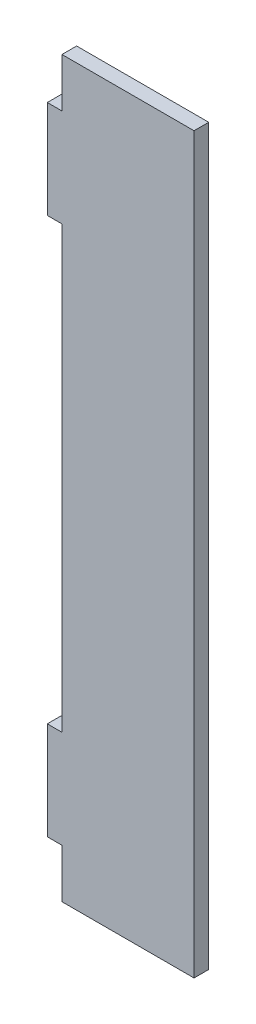
ISO-10303-21;
HEADER;
FILE_DESCRIPTION(('STEP AP214'),'2;1');
FILE_NAME('part.step','',(''),(''),'','','');
FILE_SCHEMA(('AUTOMOTIVE_DESIGN { 1 0 10303 214 1 1 1 1 }'));
ENDSEC;
DATA;
#1=APPLICATION_CONTEXT('core data for automotive mechanical design processes');
#2=APPLICATION_PROTOCOL_DEFINITION('international standard','automotive_design',2000,#1);
#3=PRODUCT_CONTEXT('',#1,'mechanical');
#4=PRODUCT('Part','Part','',(#3));
#5=PRODUCT_RELATED_PRODUCT_CATEGORY('part','',(#4));
#6=PRODUCT_DEFINITION_FORMATION('','',#4);
#7=PRODUCT_DEFINITION_CONTEXT('part definition',#1,'design');
#8=PRODUCT_DEFINITION('design','',#6,#7);
#9=PRODUCT_DEFINITION_SHAPE('','',#8);
#10=(LENGTH_UNIT() NAMED_UNIT(*) SI_UNIT(.MILLI.,.METRE.));
#11=(NAMED_UNIT(*) PLANE_ANGLE_UNIT() SI_UNIT($,.RADIAN.));
#12=(NAMED_UNIT(*) SI_UNIT($,.STERADIAN.) SOLID_ANGLE_UNIT());
#13=UNCERTAINTY_MEASURE_WITH_UNIT(LENGTH_MEASURE(1.E-05),#10,'distance_accuracy_value','');
#14=(GEOMETRIC_REPRESENTATION_CONTEXT(3) GLOBAL_UNCERTAINTY_ASSIGNED_CONTEXT((#13)) GLOBAL_UNIT_ASSIGNED_CONTEXT((#10,
#11,#12)) REPRESENTATION_CONTEXT('',''));
#15=CARTESIAN_POINT('',(0.,0.,0.));
#16=DIRECTION('',(0.,0.,1.));
#17=DIRECTION('',(1.,0.,0.));
#18=AXIS2_PLACEMENT_3D('',#15,#16,#17);
#19=CARTESIAN_POINT('',(-15.,-75.,3.));
#20=DIRECTION('',(1.,0.,0.));
#21=DIRECTION('',(0.,1.,0.));
#22=AXIS2_PLACEMENT_3D('',#19,#20,#21);
#23=PLANE('',#22);
#24=DIRECTION('',(0.,-1.,0.));
#25=VECTOR('',#24,1.);
#26=CARTESIAN_POINT('',(-15.,-75.,3.));
#27=LINE('',#26,#25);
#28=CARTESIAN_POINT('',(-15.,65.,3.));
#29=VERTEX_POINT('',#28);
#30=CARTESIAN_POINT('',(-15.,45.,3.));
#31=VERTEX_POINT('',#30);
#32=EDGE_CURVE('E142',#29,#31,#27,.T.);
#33=ORIENTED_EDGE('',*,*,#32,.F.);
#34=DIRECTION('',(0.,0.,1.));
#35=VECTOR('',#34,1.);
#36=CARTESIAN_POINT('',(-15.,65.,0.));
#37=LINE('',#36,#35);
#38=CARTESIAN_POINT('',(-15.,65.,0.));
#39=VERTEX_POINT('',#38);
#40=EDGE_CURVE('E129',#39,#29,#37,.T.);
#41=ORIENTED_EDGE('',*,*,#40,.F.);
#42=DIRECTION('',(0.,-1.,0.));
#43=VECTOR('',#42,1.);
#44=CARTESIAN_POINT('',(-15.,-75.,0.));
#45=LINE('',#44,#43);
#46=CARTESIAN_POINT('',(-15.,45.,0.));
#47=VERTEX_POINT('',#46);
#48=EDGE_CURVE('E140',#39,#47,#45,.T.);
#49=ORIENTED_EDGE('',*,*,#48,.T.);
#50=DIRECTION('',(0.,0.,1.));
#51=VECTOR('',#50,1.);
#52=CARTESIAN_POINT('',(-15.,45.,0.));
#53=LINE('',#52,#51);
#54=EDGE_CURVE('E209',#47,#31,#53,.T.);
#55=ORIENTED_EDGE('',*,*,#54,.T.);
#56=EDGE_LOOP('',(#33,#41,#49,#55));
#57=FACE_BOUND('',#56,.T.);
#58=ADVANCED_FACE('F37',(#57),#23,.F.);
#59=CARTESIAN_POINT('',(15.,-75.,3.));
#60=DIRECTION('',(-1.,0.,0.));
#61=DIRECTION('',(0.,-1.,0.));
#62=AXIS2_PLACEMENT_3D('',#59,#60,#61);
#63=PLANE('',#62);
#64=DIRECTION('',(0.,1.,0.));
#65=VECTOR('',#64,1.);
#66=CARTESIAN_POINT('',(15.,-75.,0.));
#67=LINE('',#66,#65);
#68=CARTESIAN_POINT('',(15.,-75.,0.));
#69=VERTEX_POINT('',#68);
#70=CARTESIAN_POINT('',(15.,75.,0.));
#71=VERTEX_POINT('',#70);
#72=EDGE_CURVE('E173',#69,#71,#67,.T.);
#73=ORIENTED_EDGE('',*,*,#72,.T.);
#74=DIRECTION('',(0.,0.,-1.));
#75=VECTOR('',#74,1.);
#76=CARTESIAN_POINT('',(15.,75.,3.));
#77=LINE('',#76,#75);
#78=CARTESIAN_POINT('',(15.,75.,3.));
#79=VERTEX_POINT('',#78);
#80=EDGE_CURVE('E11',#79,#71,#77,.T.);
#81=ORIENTED_EDGE('',*,*,#80,.F.);
#82=DIRECTION('',(0.,1.,0.));
#83=VECTOR('',#82,1.);
#84=CARTESIAN_POINT('',(15.,-75.,3.));
#85=LINE('',#84,#83);
#86=CARTESIAN_POINT('',(15.,-75.,3.));
#87=VERTEX_POINT('',#86);
#88=EDGE_CURVE('E152',#87,#79,#85,.T.);
#89=ORIENTED_EDGE('',*,*,#88,.F.);
#90=DIRECTION('',(0.,0.,-1.));
#91=VECTOR('',#90,1.);
#92=CARTESIAN_POINT('',(15.,-75.,3.));
#93=LINE('',#92,#91);
#94=EDGE_CURVE('E45',#87,#69,#93,.T.);
#95=ORIENTED_EDGE('',*,*,#94,.T.);
#96=EDGE_LOOP('',(#73,#81,#89,#95));
#97=FACE_BOUND('',#96,.T.);
#98=ADVANCED_FACE('F39',(#97),#63,.F.);
#99=CARTESIAN_POINT('',(-15.,75.,3.));
#100=DIRECTION('',(0.,-1.,0.));
#101=DIRECTION('',(0.,0.,-1.));
#102=AXIS2_PLACEMENT_3D('',#99,#100,#101);
#103=PLANE('',#102);
#104=DIRECTION('',(-1.,0.,0.));
#105=VECTOR('',#104,1.);
#106=CARTESIAN_POINT('',(-15.,75.,0.));
#107=LINE('',#106,#105);
#108=CARTESIAN_POINT('',(-12.,75.,0.));
#109=VERTEX_POINT('',#108);
#110=EDGE_CURVE('E155',#71,#109,#107,.T.);
#111=ORIENTED_EDGE('',*,*,#110,.T.);
#112=DIRECTION('',(0.,0.,1.));
#113=VECTOR('',#112,1.);
#114=CARTESIAN_POINT('',(-12.,75.,0.));
#115=LINE('',#114,#113);
#116=CARTESIAN_POINT('',(-12.,75.,3.));
#117=VERTEX_POINT('',#116);
#118=EDGE_CURVE('E174',#109,#117,#115,.T.);
#119=ORIENTED_EDGE('',*,*,#118,.T.);
#120=DIRECTION('',(-1.,0.,0.));
#121=VECTOR('',#120,1.);
#122=CARTESIAN_POINT('',(-15.,75.,3.));
#123=LINE('',#122,#121);
#124=EDGE_CURVE('E224',#79,#117,#123,.T.);
#125=ORIENTED_EDGE('',*,*,#124,.F.);
#126=ORIENTED_EDGE('',*,*,#80,.T.);
#127=EDGE_LOOP('',(#111,#119,#125,#126));
#128=FACE_BOUND('',#127,.T.);
#129=ADVANCED_FACE('F243',(#128),#103,.F.);
#130=CARTESIAN_POINT('',(-15.,-45.,0.));
#131=VERTEX_POINT('',#130);
#132=CARTESIAN_POINT('',(-15.,-65.,0.));
#133=VERTEX_POINT('',#132);
#134=EDGE_CURVE('E150',#131,#133,#45,.T.);
#135=ORIENTED_EDGE('',*,*,#134,.T.);
#136=DIRECTION('',(0.,0.,1.));
#137=VECTOR('',#136,1.);
#138=CARTESIAN_POINT('',(-15.,-65.,0.));
#139=LINE('',#138,#137);
#140=CARTESIAN_POINT('',(-15.,-65.,3.));
#141=VERTEX_POINT('',#140);
#142=EDGE_CURVE('E189',#133,#141,#139,.T.);
#143=ORIENTED_EDGE('',*,*,#142,.T.);
#144=CARTESIAN_POINT('',(-15.,-45.,3.));
#145=VERTEX_POINT('',#144);
#146=EDGE_CURVE('E170',#145,#141,#27,.T.);
#147=ORIENTED_EDGE('',*,*,#146,.F.);
#148=DIRECTION('',(0.,0.,1.));
#149=VECTOR('',#148,1.);
#150=CARTESIAN_POINT('',(-15.,-45.,0.));
#151=LINE('',#150,#149);
#152=EDGE_CURVE('E203',#131,#145,#151,.T.);
#153=ORIENTED_EDGE('',*,*,#152,.F.);
#154=EDGE_LOOP('',(#135,#143,#147,#153));
#155=FACE_BOUND('',#154,.T.);
#156=ADVANCED_FACE('F234',(#155),#23,.F.);
#157=CARTESIAN_POINT('',(-15.,-75.,3.));
#158=DIRECTION('',(0.,1.,0.));
#159=DIRECTION('',(0.,0.,1.));
#160=AXIS2_PLACEMENT_3D('',#157,#158,#159);
#161=PLANE('',#160);
#162=DIRECTION('',(1.,0.,0.));
#163=VECTOR('',#162,1.);
#164=CARTESIAN_POINT('',(-15.,-75.,3.));
#165=LINE('',#164,#163);
#166=CARTESIAN_POINT('',(-12.,-75.,3.));
#167=VERTEX_POINT('',#166);
#168=EDGE_CURVE('E159',#167,#87,#165,.T.);
#169=ORIENTED_EDGE('',*,*,#168,.F.);
#170=DIRECTION('',(0.,0.,1.));
#171=VECTOR('',#170,1.);
#172=CARTESIAN_POINT('',(-12.,-75.,0.));
#173=LINE('',#172,#171);
#174=CARTESIAN_POINT('',(-12.,-75.,0.));
#175=VERTEX_POINT('',#174);
#176=EDGE_CURVE('E185',#175,#167,#173,.T.);
#177=ORIENTED_EDGE('',*,*,#176,.F.);
#178=DIRECTION('',(1.,0.,0.));
#179=VECTOR('',#178,1.);
#180=CARTESIAN_POINT('',(-15.,-75.,0.));
#181=LINE('',#180,#179);
#182=EDGE_CURVE('E149',#175,#69,#181,.T.);
#183=ORIENTED_EDGE('',*,*,#182,.T.);
#184=ORIENTED_EDGE('',*,*,#94,.F.);
#185=EDGE_LOOP('',(#169,#177,#183,#184));
#186=FACE_BOUND('',#185,.T.);
#187=ADVANCED_FACE('F242',(#186),#161,.F.);
#188=CARTESIAN_POINT('',(0.,0.,3.));
#189=DIRECTION('',(0.,0.,-1.));
#190=DIRECTION('',(-1.,0.,0.));
#191=AXIS2_PLACEMENT_3D('',#188,#189,#190);
#192=PLANE('',#191);
#193=ORIENTED_EDGE('',*,*,#124,.T.);
#194=DIRECTION('',(0.,1.,0.));
#195=VECTOR('',#194,1.);
#196=CARTESIAN_POINT('',(-12.,75.,3.));
#197=LINE('',#196,#195);
#198=CARTESIAN_POINT('',(-12.,65.,3.));
#199=VERTEX_POINT('',#198);
#200=EDGE_CURVE('E134',#199,#117,#197,.T.);
#201=ORIENTED_EDGE('',*,*,#200,.F.);
#202=DIRECTION('',(1.,0.,0.));
#203=VECTOR('',#202,1.);
#204=CARTESIAN_POINT('',(-15.,65.,3.));
#205=LINE('',#204,#203);
#206=EDGE_CURVE('E199',#29,#199,#205,.T.);
#207=ORIENTED_EDGE('',*,*,#206,.F.);
#208=ORIENTED_EDGE('',*,*,#32,.T.);
#209=DIRECTION('',(-1.,0.,0.));
#210=VECTOR('',#209,1.);
#211=CARTESIAN_POINT('',(-15.,45.,3.));
#212=LINE('',#211,#210);
#213=CARTESIAN_POINT('',(-12.,45.,3.));
#214=VERTEX_POINT('',#213);
#215=EDGE_CURVE('E211',#214,#31,#212,.T.);
#216=ORIENTED_EDGE('',*,*,#215,.F.);
#217=DIRECTION('',(0.,1.,0.));
#218=VECTOR('',#217,1.);
#219=CARTESIAN_POINT('',(-12.,45.,3.));
#220=LINE('',#219,#218);
#221=CARTESIAN_POINT('',(-12.,-45.,3.));
#222=VERTEX_POINT('',#221);
#223=EDGE_CURVE('E213',#222,#214,#220,.T.);
#224=ORIENTED_EDGE('',*,*,#223,.F.);
#225=DIRECTION('',(1.,0.,0.));
#226=VECTOR('',#225,1.);
#227=CARTESIAN_POINT('',(-15.,-45.,3.));
#228=LINE('',#227,#226);
#229=EDGE_CURVE('E192',#145,#222,#228,.T.);
#230=ORIENTED_EDGE('',*,*,#229,.F.);
#231=ORIENTED_EDGE('',*,*,#146,.T.);
#232=DIRECTION('',(-1.,0.,0.));
#233=VECTOR('',#232,1.);
#234=CARTESIAN_POINT('',(-15.,-65.,3.));
#235=LINE('',#234,#233);
#236=CARTESIAN_POINT('',(-12.,-65.,3.));
#237=VERTEX_POINT('',#236);
#238=EDGE_CURVE('E193',#237,#141,#235,.T.);
#239=ORIENTED_EDGE('',*,*,#238,.F.);
#240=DIRECTION('',(0.,1.,0.));
#241=VECTOR('',#240,1.);
#242=CARTESIAN_POINT('',(-12.,-75.,3.));
#243=LINE('',#242,#241);
#244=EDGE_CURVE('E195',#167,#237,#243,.T.);
#245=ORIENTED_EDGE('',*,*,#244,.F.);
#246=ORIENTED_EDGE('',*,*,#168,.T.);
#247=ORIENTED_EDGE('',*,*,#88,.T.);
#248=EDGE_LOOP('',(#193,#201,#207,#208,#216,#224,#230,#231,#239,#245,#246,#247));
#249=FACE_BOUND('',#248,.T.);
#250=ADVANCED_FACE('F230',(#249),#192,.F.);
#251=CARTESIAN_POINT('',(0.,0.,0.));
#252=DIRECTION('',(0.,0.,-1.));
#253=DIRECTION('',(-1.,0.,0.));
#254=AXIS2_PLACEMENT_3D('',#251,#252,#253);
#255=PLANE('',#254);
#256=DIRECTION('',(0.,1.,0.));
#257=VECTOR('',#256,1.);
#258=CARTESIAN_POINT('',(-12.,75.,0.));
#259=LINE('',#258,#257);
#260=CARTESIAN_POINT('',(-12.,65.,0.));
#261=VERTEX_POINT('',#260);
#262=EDGE_CURVE('E52',#261,#109,#259,.T.);
#263=ORIENTED_EDGE('',*,*,#262,.T.);
#264=ORIENTED_EDGE('',*,*,#110,.F.);
#265=ORIENTED_EDGE('',*,*,#72,.F.);
#266=ORIENTED_EDGE('',*,*,#182,.F.);
#267=DIRECTION('',(0.,1.,0.));
#268=VECTOR('',#267,1.);
#269=CARTESIAN_POINT('',(-12.,-75.,0.));
#270=LINE('',#269,#268);
#271=CARTESIAN_POINT('',(-12.,-65.,0.));
#272=VERTEX_POINT('',#271);
#273=EDGE_CURVE('E196',#175,#272,#270,.T.);
#274=ORIENTED_EDGE('',*,*,#273,.T.);
#275=DIRECTION('',(-1.,0.,0.));
#276=VECTOR('',#275,1.);
#277=CARTESIAN_POINT('',(-15.,-65.,0.));
#278=LINE('',#277,#276);
#279=EDGE_CURVE('E60',#272,#133,#278,.T.);
#280=ORIENTED_EDGE('',*,*,#279,.T.);
#281=ORIENTED_EDGE('',*,*,#134,.F.);
#282=DIRECTION('',(1.,0.,0.));
#283=VECTOR('',#282,1.);
#284=CARTESIAN_POINT('',(-15.,-45.,0.));
#285=LINE('',#284,#283);
#286=CARTESIAN_POINT('',(-12.,-45.,0.));
#287=VERTEX_POINT('',#286);
#288=EDGE_CURVE('E214',#131,#287,#285,.T.);
#289=ORIENTED_EDGE('',*,*,#288,.T.);
#290=DIRECTION('',(0.,1.,0.));
#291=VECTOR('',#290,1.);
#292=CARTESIAN_POINT('',(-12.,45.,0.));
#293=LINE('',#292,#291);
#294=CARTESIAN_POINT('',(-12.,45.,0.));
#295=VERTEX_POINT('',#294);
#296=EDGE_CURVE('E220',#287,#295,#293,.T.);
#297=ORIENTED_EDGE('',*,*,#296,.T.);
#298=DIRECTION('',(-1.,0.,0.));
#299=VECTOR('',#298,1.);
#300=CARTESIAN_POINT('',(-15.,45.,0.));
#301=LINE('',#300,#299);
#302=EDGE_CURVE('E148',#295,#47,#301,.T.);
#303=ORIENTED_EDGE('',*,*,#302,.T.);
#304=ORIENTED_EDGE('',*,*,#48,.F.);
#305=DIRECTION('',(1.,0.,0.));
#306=VECTOR('',#305,1.);
#307=CARTESIAN_POINT('',(-15.,65.,0.));
#308=LINE('',#307,#306);
#309=EDGE_CURVE('E125',#39,#261,#308,.T.);
#310=ORIENTED_EDGE('',*,*,#309,.T.);
#311=EDGE_LOOP('',(#263,#264,#265,#266,#274,#280,#281,#289,#297,#303,#304,#310));
#312=FACE_BOUND('',#311,.T.);
#313=ADVANCED_FACE('F145',(#312),#255,.T.);
#314=CARTESIAN_POINT('',(-15.,45.,0.));
#315=DIRECTION('',(0.,1.,0.));
#316=DIRECTION('',(0.,0.,1.));
#317=AXIS2_PLACEMENT_3D('',#314,#315,#316);
#318=PLANE('',#317);
#319=ORIENTED_EDGE('',*,*,#215,.T.);
#320=ORIENTED_EDGE('',*,*,#54,.F.);
#321=ORIENTED_EDGE('',*,*,#302,.F.);
#322=DIRECTION('',(0.,0.,1.));
#323=VECTOR('',#322,1.);
#324=CARTESIAN_POINT('',(-12.,45.,0.));
#325=LINE('',#324,#323);
#326=EDGE_CURVE('E207',#295,#214,#325,.T.);
#327=ORIENTED_EDGE('',*,*,#326,.T.);
#328=EDGE_LOOP('',(#319,#320,#321,#327));
#329=FACE_BOUND('',#328,.T.);
#330=ADVANCED_FACE('F248',(#329),#318,.F.);
#331=CARTESIAN_POINT('',(-12.,45.,0.));
#332=DIRECTION('',(1.,0.,0.));
#333=DIRECTION('',(0.,1.,0.));
#334=AXIS2_PLACEMENT_3D('',#331,#332,#333);
#335=PLANE('',#334);
#336=ORIENTED_EDGE('',*,*,#223,.T.);
#337=ORIENTED_EDGE('',*,*,#326,.F.);
#338=ORIENTED_EDGE('',*,*,#296,.F.);
#339=DIRECTION('',(0.,0.,1.));
#340=VECTOR('',#339,1.);
#341=CARTESIAN_POINT('',(-12.,-45.,0.));
#342=LINE('',#341,#340);
#343=EDGE_CURVE('E205',#287,#222,#342,.T.);
#344=ORIENTED_EDGE('',*,*,#343,.T.);
#345=EDGE_LOOP('',(#336,#337,#338,#344));
#346=FACE_BOUND('',#345,.T.);
#347=ADVANCED_FACE('F250',(#346),#335,.F.);
#348=CARTESIAN_POINT('',(-15.,-45.,0.));
#349=DIRECTION('',(0.,-1.,0.));
#350=DIRECTION('',(0.,0.,-1.));
#351=AXIS2_PLACEMENT_3D('',#348,#349,#350);
#352=PLANE('',#351);
#353=ORIENTED_EDGE('',*,*,#229,.T.);
#354=ORIENTED_EDGE('',*,*,#343,.F.);
#355=ORIENTED_EDGE('',*,*,#288,.F.);
#356=ORIENTED_EDGE('',*,*,#152,.T.);
#357=EDGE_LOOP('',(#353,#354,#355,#356));
#358=FACE_BOUND('',#357,.T.);
#359=ADVANCED_FACE('F253',(#358),#352,.F.);
#360=CARTESIAN_POINT('',(-15.,-65.,0.));
#361=DIRECTION('',(0.,1.,0.));
#362=DIRECTION('',(0.,0.,1.));
#363=AXIS2_PLACEMENT_3D('',#360,#361,#362);
#364=PLANE('',#363);
#365=ORIENTED_EDGE('',*,*,#238,.T.);
#366=ORIENTED_EDGE('',*,*,#142,.F.);
#367=ORIENTED_EDGE('',*,*,#279,.F.);
#368=DIRECTION('',(0.,0.,1.));
#369=VECTOR('',#368,1.);
#370=CARTESIAN_POINT('',(-12.,-65.,0.));
#371=LINE('',#370,#369);
#372=EDGE_CURVE('E187',#272,#237,#371,.T.);
#373=ORIENTED_EDGE('',*,*,#372,.T.);
#374=EDGE_LOOP('',(#365,#366,#367,#373));
#375=FACE_BOUND('',#374,.T.);
#376=ADVANCED_FACE('F236',(#375),#364,.F.);
#377=CARTESIAN_POINT('',(-12.,-75.,0.));
#378=DIRECTION('',(1.,0.,0.));
#379=DIRECTION('',(0.,0.,-1.));
#380=AXIS2_PLACEMENT_3D('',#377,#378,#379);
#381=PLANE('',#380);
#382=ORIENTED_EDGE('',*,*,#244,.T.);
#383=ORIENTED_EDGE('',*,*,#372,.F.);
#384=ORIENTED_EDGE('',*,*,#273,.F.);
#385=ORIENTED_EDGE('',*,*,#176,.T.);
#386=EDGE_LOOP('',(#382,#383,#384,#385));
#387=FACE_BOUND('',#386,.T.);
#388=ADVANCED_FACE('F240',(#387),#381,.F.);
#389=CARTESIAN_POINT('',(-12.,75.,0.));
#390=DIRECTION('',(1.,0.,0.));
#391=DIRECTION('',(0.,1.,0.));
#392=AXIS2_PLACEMENT_3D('',#389,#390,#391);
#393=PLANE('',#392);
#394=ORIENTED_EDGE('',*,*,#200,.T.);
#395=ORIENTED_EDGE('',*,*,#118,.F.);
#396=ORIENTED_EDGE('',*,*,#262,.F.);
#397=DIRECTION('',(0.,0.,1.));
#398=VECTOR('',#397,1.);
#399=CARTESIAN_POINT('',(-12.,65.,0.));
#400=LINE('',#399,#398);
#401=EDGE_CURVE('E131',#261,#199,#400,.T.);
#402=ORIENTED_EDGE('',*,*,#401,.T.);
#403=EDGE_LOOP('',(#394,#395,#396,#402));
#404=FACE_BOUND('',#403,.T.);
#405=ADVANCED_FACE('F245',(#404),#393,.F.);
#406=CARTESIAN_POINT('',(-15.,65.,0.));
#407=DIRECTION('',(0.,-1.,0.));
#408=DIRECTION('',(0.,0.,-1.));
#409=AXIS2_PLACEMENT_3D('',#406,#407,#408);
#410=PLANE('',#409);
#411=ORIENTED_EDGE('',*,*,#206,.T.);
#412=ORIENTED_EDGE('',*,*,#401,.F.);
#413=ORIENTED_EDGE('',*,*,#309,.F.);
#414=ORIENTED_EDGE('',*,*,#40,.T.);
#415=EDGE_LOOP('',(#411,#412,#413,#414));
#416=FACE_BOUND('',#415,.T.);
#417=ADVANCED_FACE('F128',(#416),#410,.F.);
#418=CLOSED_SHELL('',(#58,#98,#129,#156,#187,#250,#313,#330,#347,#359,#376,#388,#405,#417));
#419=MANIFOLD_SOLID_BREP('B2',#418);
#420=ADVANCED_BREP_SHAPE_REPRESENTATION('',(#18,#419),#14);
#421=SHAPE_DEFINITION_REPRESENTATION(#9,#420);
ENDSEC;
END-ISO-10303-21;
